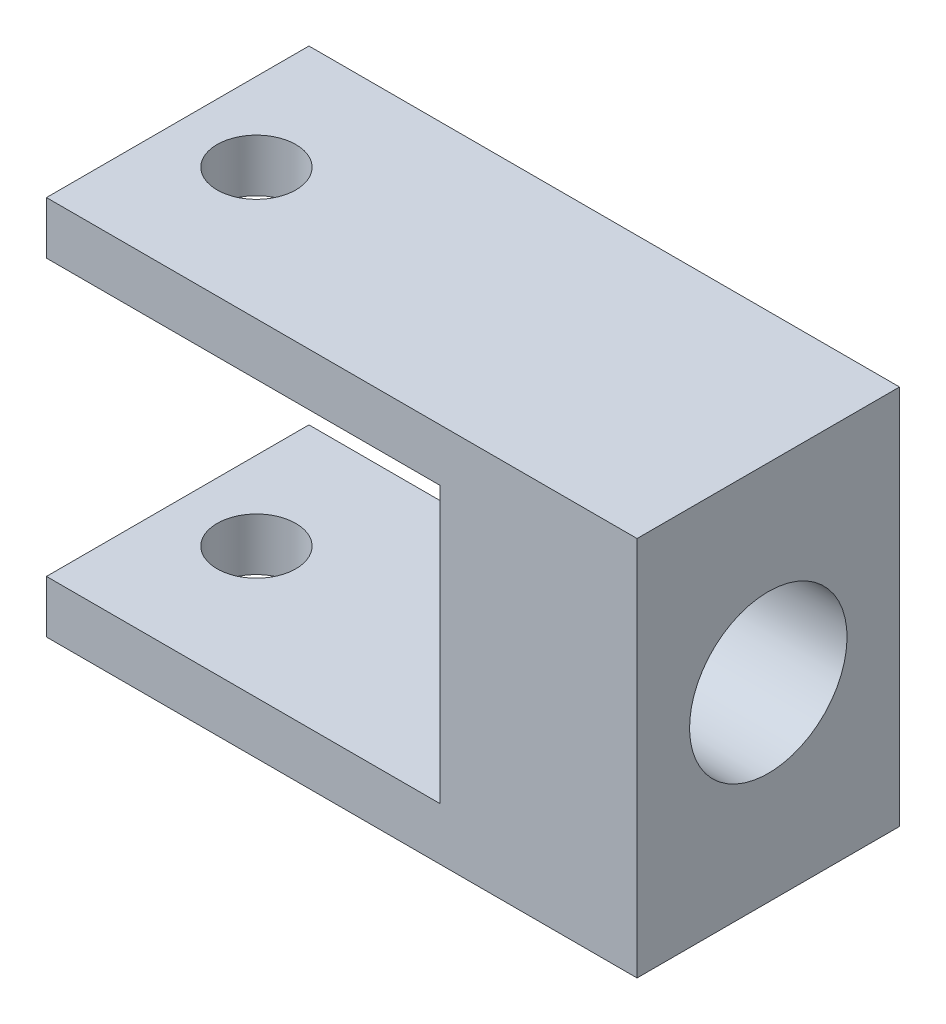
ISO-10303-21;
HEADER;
FILE_DESCRIPTION(('STEP AP214'),'2;1');
FILE_NAME('part.step','',(''),(''),'','','');
FILE_SCHEMA(('AUTOMOTIVE_DESIGN { 1 0 10303 214 1 1 1 1 }'));
ENDSEC;
DATA;
#1=APPLICATION_CONTEXT('core data for automotive mechanical design processes');
#2=APPLICATION_PROTOCOL_DEFINITION('international standard','automotive_design',2000,#1);
#3=PRODUCT_CONTEXT('',#1,'mechanical');
#4=PRODUCT('Part','Part','',(#3));
#5=PRODUCT_RELATED_PRODUCT_CATEGORY('part','',(#4));
#6=PRODUCT_DEFINITION_FORMATION('','',#4);
#7=PRODUCT_DEFINITION_CONTEXT('part definition',#1,'design');
#8=PRODUCT_DEFINITION('design','',#6,#7);
#9=PRODUCT_DEFINITION_SHAPE('','',#8);
#10=(LENGTH_UNIT() NAMED_UNIT(*) SI_UNIT(.MILLI.,.METRE.));
#11=(NAMED_UNIT(*) PLANE_ANGLE_UNIT() SI_UNIT($,.RADIAN.));
#12=(NAMED_UNIT(*) SI_UNIT($,.STERADIAN.) SOLID_ANGLE_UNIT());
#13=UNCERTAINTY_MEASURE_WITH_UNIT(LENGTH_MEASURE(1.E-05),#10,'distance_accuracy_value','');
#14=(GEOMETRIC_REPRESENTATION_CONTEXT(3) GLOBAL_UNCERTAINTY_ASSIGNED_CONTEXT((#13)) GLOBAL_UNIT_ASSIGNED_CONTEXT((#10,
#11,#12)) REPRESENTATION_CONTEXT('',''));
#15=CARTESIAN_POINT('',(0.,0.,0.));
#16=DIRECTION('',(0.,0.,1.));
#17=DIRECTION('',(1.,0.,0.));
#18=AXIS2_PLACEMENT_3D('',#15,#16,#17);
#19=CARTESIAN_POINT('',(-22.5,14.5,20.));
#20=DIRECTION('',(1.,0.,0.));
#21=DIRECTION('',(0.,0.,-1.));
#22=AXIS2_PLACEMENT_3D('',#19,#20,#21);
#23=PLANE('',#22);
#24=DIRECTION('',(0.,-1.,0.));
#25=VECTOR('',#24,1.);
#26=CARTESIAN_POINT('',(-22.5,14.5,0.));
#27=LINE('',#26,#25);
#28=CARTESIAN_POINT('',(-22.5,14.5,0.));
#29=VERTEX_POINT('',#28);
#30=CARTESIAN_POINT('',(-22.5,10.5,0.));
#31=VERTEX_POINT('',#30);
#32=EDGE_CURVE('E132',#29,#31,#27,.T.);
#33=ORIENTED_EDGE('',*,*,#32,.T.);
#34=DIRECTION('',(0.,0.,-1.));
#35=VECTOR('',#34,1.);
#36=CARTESIAN_POINT('',(-22.5,10.5,20.));
#37=LINE('',#36,#35);
#38=CARTESIAN_POINT('',(-22.5,10.5,20.));
#39=VERTEX_POINT('',#38);
#40=EDGE_CURVE('E11',#39,#31,#37,.T.);
#41=ORIENTED_EDGE('',*,*,#40,.F.);
#42=DIRECTION('',(0.,-1.,0.));
#43=VECTOR('',#42,1.);
#44=CARTESIAN_POINT('',(-22.5,14.5,20.));
#45=LINE('',#44,#43);
#46=CARTESIAN_POINT('',(-22.5,14.5,20.));
#47=VERTEX_POINT('',#46);
#48=EDGE_CURVE('E147',#47,#39,#45,.T.);
#49=ORIENTED_EDGE('',*,*,#48,.F.);
#50=DIRECTION('',(0.,0.,-1.));
#51=VECTOR('',#50,1.);
#52=CARTESIAN_POINT('',(-22.5,14.5,20.));
#53=LINE('',#52,#51);
#54=EDGE_CURVE('E128',#47,#29,#53,.T.);
#55=ORIENTED_EDGE('',*,*,#54,.T.);
#56=EDGE_LOOP('',(#33,#41,#49,#55));
#57=FACE_BOUND('',#56,.T.);
#58=ADVANCED_FACE('F35',(#57),#23,.F.);
#59=CARTESIAN_POINT('',(-22.5,10.5,20.));
#60=DIRECTION('',(0.,1.,0.));
#61=DIRECTION('',(0.,0.,1.));
#62=AXIS2_PLACEMENT_3D('',#59,#60,#61);
#63=PLANE('',#62);
#64=CARTESIAN_POINT('',(-16.5,10.5,10.));
#65=DIRECTION('',(0.,1.,0.));
#66=DIRECTION('',(0.,0.,1.));
#67=AXIS2_PLACEMENT_3D('',#64,#65,#66);
#68=CIRCLE('',#67,3.);
#69=CARTESIAN_POINT('',(-16.5,10.5,13.));
#70=VERTEX_POINT('',#69);
#71=EDGE_CURVE('E186',#70,#70,#68,.T.);
#72=ORIENTED_EDGE('',*,*,#71,.T.);
#73=EDGE_LOOP('',(#72));
#74=FACE_BOUND('',#73,.T.);
#75=DIRECTION('',(1.,0.,0.));
#76=VECTOR('',#75,1.);
#77=CARTESIAN_POINT('',(-22.5,10.5,0.));
#78=LINE('',#77,#76);
#79=CARTESIAN_POINT('',(7.5,10.5,0.));
#80=VERTEX_POINT('',#79);
#81=EDGE_CURVE('E135',#31,#80,#78,.T.);
#82=ORIENTED_EDGE('',*,*,#81,.T.);
#83=DIRECTION('',(0.,0.,-1.));
#84=VECTOR('',#83,1.);
#85=CARTESIAN_POINT('',(7.5,10.5,20.));
#86=LINE('',#85,#84);
#87=CARTESIAN_POINT('',(7.5,10.5,20.));
#88=VERTEX_POINT('',#87);
#89=EDGE_CURVE('E44',#88,#80,#86,.T.);
#90=ORIENTED_EDGE('',*,*,#89,.F.);
#91=DIRECTION('',(1.,0.,0.));
#92=VECTOR('',#91,1.);
#93=CARTESIAN_POINT('',(-22.5,10.5,20.));
#94=LINE('',#93,#92);
#95=EDGE_CURVE('E95',#39,#88,#94,.T.);
#96=ORIENTED_EDGE('',*,*,#95,.F.);
#97=ORIENTED_EDGE('',*,*,#40,.T.);
#98=EDGE_LOOP('',(#82,#90,#96,#97));
#99=FACE_BOUND('',#98,.T.);
#100=ADVANCED_FACE('F209',(#74,#99),#63,.F.);
#101=CARTESIAN_POINT('',(7.5,10.5,20.));
#102=DIRECTION('',(1.,0.,0.));
#103=DIRECTION('',(0.,1.,0.));
#104=AXIS2_PLACEMENT_3D('',#101,#102,#103);
#105=PLANE('',#104);
#106=CARTESIAN_POINT('',(7.5,0.,10.));
#107=DIRECTION('',(1.,0.,0.));
#108=DIRECTION('',(0.,1.,0.));
#109=AXIS2_PLACEMENT_3D('',#106,#107,#108);
#110=CIRCLE('',#109,6.);
#111=CARTESIAN_POINT('',(7.5,5.99999999999999,10.));
#112=VERTEX_POINT('',#111);
#113=EDGE_CURVE('E136',#112,#112,#110,.T.);
#114=ORIENTED_EDGE('',*,*,#113,.T.);
#115=EDGE_LOOP('',(#114));
#116=FACE_BOUND('',#115,.T.);
#117=DIRECTION('',(0.,-1.,0.));
#118=VECTOR('',#117,1.);
#119=CARTESIAN_POINT('',(7.5,10.5,0.));
#120=LINE('',#119,#118);
#121=CARTESIAN_POINT('',(7.5,-10.5,0.));
#122=VERTEX_POINT('',#121);
#123=EDGE_CURVE('E138',#80,#122,#120,.T.);
#124=ORIENTED_EDGE('',*,*,#123,.T.);
#125=DIRECTION('',(0.,0.,-1.));
#126=VECTOR('',#125,1.);
#127=CARTESIAN_POINT('',(7.5,-10.5,20.));
#128=LINE('',#127,#126);
#129=CARTESIAN_POINT('',(7.5,-10.5,20.));
#130=VERTEX_POINT('',#129);
#131=EDGE_CURVE('E154',#130,#122,#128,.T.);
#132=ORIENTED_EDGE('',*,*,#131,.F.);
#133=DIRECTION('',(0.,-1.,0.));
#134=VECTOR('',#133,1.);
#135=CARTESIAN_POINT('',(7.5,10.5,20.));
#136=LINE('',#135,#134);
#137=EDGE_CURVE('E163',#88,#130,#136,.T.);
#138=ORIENTED_EDGE('',*,*,#137,.F.);
#139=ORIENTED_EDGE('',*,*,#89,.T.);
#140=EDGE_LOOP('',(#124,#132,#138,#139));
#141=FACE_BOUND('',#140,.T.);
#142=ADVANCED_FACE('F161',(#116,#141),#105,.F.);
#143=CARTESIAN_POINT('',(-22.5,-10.5,20.));
#144=DIRECTION('',(0.,-1.,0.));
#145=DIRECTION('',(0.,0.,-1.));
#146=AXIS2_PLACEMENT_3D('',#143,#144,#145);
#147=PLANE('',#146);
#148=CARTESIAN_POINT('',(-16.5,-10.5,10.));
#149=DIRECTION('',(0.,-1.,0.));
#150=DIRECTION('',(0.,0.,-1.));
#151=AXIS2_PLACEMENT_3D('',#148,#149,#150);
#152=CIRCLE('',#151,3.);
#153=CARTESIAN_POINT('',(-16.5,-10.5,7.));
#154=VERTEX_POINT('',#153);
#155=EDGE_CURVE('E189',#154,#154,#152,.T.);
#156=ORIENTED_EDGE('',*,*,#155,.T.);
#157=EDGE_LOOP('',(#156));
#158=FACE_BOUND('',#157,.T.);
#159=DIRECTION('',(-1.,0.,0.));
#160=VECTOR('',#159,1.);
#161=CARTESIAN_POINT('',(-22.5,-10.5,0.));
#162=LINE('',#161,#160);
#163=CARTESIAN_POINT('',(-22.5,-10.5,0.));
#164=VERTEX_POINT('',#163);
#165=EDGE_CURVE('E140',#122,#164,#162,.T.);
#166=ORIENTED_EDGE('',*,*,#165,.T.);
#167=DIRECTION('',(0.,0.,-1.));
#168=VECTOR('',#167,1.);
#169=CARTESIAN_POINT('',(-22.5,-10.5,20.));
#170=LINE('',#169,#168);
#171=CARTESIAN_POINT('',(-22.5,-10.5,20.));
#172=VERTEX_POINT('',#171);
#173=EDGE_CURVE('E151',#172,#164,#170,.T.);
#174=ORIENTED_EDGE('',*,*,#173,.F.);
#175=DIRECTION('',(-1.,0.,0.));
#176=VECTOR('',#175,1.);
#177=CARTESIAN_POINT('',(-22.5,-10.5,20.));
#178=LINE('',#177,#176);
#179=EDGE_CURVE('E175',#130,#172,#178,.T.);
#180=ORIENTED_EDGE('',*,*,#179,.F.);
#181=ORIENTED_EDGE('',*,*,#131,.T.);
#182=EDGE_LOOP('',(#166,#174,#180,#181));
#183=FACE_BOUND('',#182,.T.);
#184=ADVANCED_FACE('F171',(#158,#183),#147,.F.);
#185=CARTESIAN_POINT('',(-22.5,-10.5,20.));
#186=DIRECTION('',(1.,0.,0.));
#187=DIRECTION('',(0.,0.,-1.));
#188=AXIS2_PLACEMENT_3D('',#185,#186,#187);
#189=PLANE('',#188);
#190=DIRECTION('',(0.,-1.,0.));
#191=VECTOR('',#190,1.);
#192=CARTESIAN_POINT('',(-22.5,-10.5,0.));
#193=LINE('',#192,#191);
#194=CARTESIAN_POINT('',(-22.5,-14.5,0.));
#195=VERTEX_POINT('',#194);
#196=EDGE_CURVE('E142',#164,#195,#193,.T.);
#197=ORIENTED_EDGE('',*,*,#196,.T.);
#198=DIRECTION('',(0.,0.,-1.));
#199=VECTOR('',#198,1.);
#200=CARTESIAN_POINT('',(-22.5,-14.5,20.));
#201=LINE('',#200,#199);
#202=CARTESIAN_POINT('',(-22.5,-14.5,20.));
#203=VERTEX_POINT('',#202);
#204=EDGE_CURVE('E123',#203,#195,#201,.T.);
#205=ORIENTED_EDGE('',*,*,#204,.F.);
#206=DIRECTION('',(0.,-1.,0.));
#207=VECTOR('',#206,1.);
#208=CARTESIAN_POINT('',(-22.5,-10.5,20.));
#209=LINE('',#208,#207);
#210=EDGE_CURVE('E114',#172,#203,#209,.T.);
#211=ORIENTED_EDGE('',*,*,#210,.F.);
#212=ORIENTED_EDGE('',*,*,#173,.T.);
#213=EDGE_LOOP('',(#197,#205,#211,#212));
#214=FACE_BOUND('',#213,.T.);
#215=ADVANCED_FACE('F174',(#214),#189,.F.);
#216=CARTESIAN_POINT('',(-22.5,-14.5,20.));
#217=DIRECTION('',(0.,1.,0.));
#218=DIRECTION('',(0.,0.,1.));
#219=AXIS2_PLACEMENT_3D('',#216,#217,#218);
#220=PLANE('',#219);
#221=CARTESIAN_POINT('',(-16.5,-14.5,10.));
#222=DIRECTION('',(0.,-1.,0.));
#223=DIRECTION('',(0.,0.,-1.));
#224=AXIS2_PLACEMENT_3D('',#221,#222,#223);
#225=CIRCLE('',#224,3.);
#226=CARTESIAN_POINT('',(-16.5,-14.5,7.));
#227=VERTEX_POINT('',#226);
#228=EDGE_CURVE('E192',#227,#227,#225,.T.);
#229=ORIENTED_EDGE('',*,*,#228,.F.);
#230=EDGE_LOOP('',(#229));
#231=FACE_BOUND('',#230,.T.);
#232=DIRECTION('',(1.,0.,0.));
#233=VECTOR('',#232,1.);
#234=CARTESIAN_POINT('',(-22.5,-14.5,0.));
#235=LINE('',#234,#233);
#236=CARTESIAN_POINT('',(22.5,-14.5,0.));
#237=VERTEX_POINT('',#236);
#238=EDGE_CURVE('E122',#195,#237,#235,.T.);
#239=ORIENTED_EDGE('',*,*,#238,.T.);
#240=DIRECTION('',(0.,0.,-1.));
#241=VECTOR('',#240,1.);
#242=CARTESIAN_POINT('',(22.5,-14.5,20.));
#243=LINE('',#242,#241);
#244=CARTESIAN_POINT('',(22.5,-14.5,20.));
#245=VERTEX_POINT('',#244);
#246=EDGE_CURVE('E119',#245,#237,#243,.T.);
#247=ORIENTED_EDGE('',*,*,#246,.F.);
#248=DIRECTION('',(1.,0.,0.));
#249=VECTOR('',#248,1.);
#250=CARTESIAN_POINT('',(-22.5,-14.5,20.));
#251=LINE('',#250,#249);
#252=EDGE_CURVE('E108',#203,#245,#251,.T.);
#253=ORIENTED_EDGE('',*,*,#252,.F.);
#254=ORIENTED_EDGE('',*,*,#204,.T.);
#255=EDGE_LOOP('',(#239,#247,#253,#254));
#256=FACE_BOUND('',#255,.T.);
#257=ADVANCED_FACE('F120',(#231,#256),#220,.F.);
#258=CARTESIAN_POINT('',(22.5,14.5,20.));
#259=DIRECTION('',(-1.,0.,0.));
#260=DIRECTION('',(0.,-1.,0.));
#261=AXIS2_PLACEMENT_3D('',#258,#259,#260);
#262=PLANE('',#261);
#263=CARTESIAN_POINT('',(22.5,0.,10.));
#264=DIRECTION('',(1.,0.,0.));
#265=DIRECTION('',(0.,1.,0.));
#266=AXIS2_PLACEMENT_3D('',#263,#264,#265);
#267=CIRCLE('',#266,6.);
#268=CARTESIAN_POINT('',(22.5,5.99999999999999,10.));
#269=VERTEX_POINT('',#268);
#270=EDGE_CURVE('E183',#269,#269,#267,.T.);
#271=ORIENTED_EDGE('',*,*,#270,.F.);
#272=EDGE_LOOP('',(#271));
#273=FACE_BOUND('',#272,.T.);
#274=DIRECTION('',(0.,1.,0.));
#275=VECTOR('',#274,1.);
#276=CARTESIAN_POINT('',(22.5,14.5,0.));
#277=LINE('',#276,#275);
#278=CARTESIAN_POINT('',(22.5,14.5,0.));
#279=VERTEX_POINT('',#278);
#280=EDGE_CURVE('E81',#237,#279,#277,.T.);
#281=ORIENTED_EDGE('',*,*,#280,.T.);
#282=DIRECTION('',(0.,0.,-1.));
#283=VECTOR('',#282,1.);
#284=CARTESIAN_POINT('',(22.5,14.5,20.));
#285=LINE('',#284,#283);
#286=CARTESIAN_POINT('',(22.5,14.5,20.));
#287=VERTEX_POINT('',#286);
#288=EDGE_CURVE('E124',#287,#279,#285,.T.);
#289=ORIENTED_EDGE('',*,*,#288,.F.);
#290=DIRECTION('',(0.,1.,0.));
#291=VECTOR('',#290,1.);
#292=CARTESIAN_POINT('',(22.5,14.5,20.));
#293=LINE('',#292,#291);
#294=EDGE_CURVE('E112',#245,#287,#293,.T.);
#295=ORIENTED_EDGE('',*,*,#294,.F.);
#296=ORIENTED_EDGE('',*,*,#246,.T.);
#297=EDGE_LOOP('',(#281,#289,#295,#296));
#298=FACE_BOUND('',#297,.T.);
#299=ADVANCED_FACE('F126',(#273,#298),#262,.F.);
#300=CARTESIAN_POINT('',(-22.5,14.5,20.));
#301=DIRECTION('',(0.,-1.,0.));
#302=DIRECTION('',(0.,0.,-1.));
#303=AXIS2_PLACEMENT_3D('',#300,#301,#302);
#304=PLANE('',#303);
#305=CARTESIAN_POINT('',(-16.5,14.5,10.));
#306=DIRECTION('',(0.,-1.,0.));
#307=DIRECTION('',(0.,0.,-1.));
#308=AXIS2_PLACEMENT_3D('',#305,#306,#307);
#309=CIRCLE('',#308,3.);
#310=CARTESIAN_POINT('',(-16.5,14.5,7.));
#311=VERTEX_POINT('',#310);
#312=EDGE_CURVE('E38',#311,#311,#309,.T.);
#313=ORIENTED_EDGE('',*,*,#312,.T.);
#314=EDGE_LOOP('',(#313));
#315=FACE_BOUND('',#314,.T.);
#316=DIRECTION('',(-1.,0.,0.));
#317=VECTOR('',#316,1.);
#318=CARTESIAN_POINT('',(-22.5,14.5,0.));
#319=LINE('',#318,#317);
#320=EDGE_CURVE('E87',#279,#29,#319,.T.);
#321=ORIENTED_EDGE('',*,*,#320,.T.);
#322=ORIENTED_EDGE('',*,*,#54,.F.);
#323=DIRECTION('',(-1.,0.,0.));
#324=VECTOR('',#323,1.);
#325=CARTESIAN_POINT('',(-22.5,14.5,20.));
#326=LINE('',#325,#324);
#327=EDGE_CURVE('E52',#287,#47,#326,.T.);
#328=ORIENTED_EDGE('',*,*,#327,.F.);
#329=ORIENTED_EDGE('',*,*,#288,.T.);
#330=EDGE_LOOP('',(#321,#322,#328,#329));
#331=FACE_BOUND('',#330,.T.);
#332=ADVANCED_FACE('F199',(#315,#331),#304,.F.);
#333=CARTESIAN_POINT('',(0.,0.,20.));
#334=DIRECTION('',(0.,0.,1.));
#335=DIRECTION('',(1.,0.,0.));
#336=AXIS2_PLACEMENT_3D('',#333,#334,#335);
#337=PLANE('',#336);
#338=ORIENTED_EDGE('',*,*,#48,.T.);
#339=ORIENTED_EDGE('',*,*,#95,.T.);
#340=ORIENTED_EDGE('',*,*,#137,.T.);
#341=ORIENTED_EDGE('',*,*,#179,.T.);
#342=ORIENTED_EDGE('',*,*,#210,.T.);
#343=ORIENTED_EDGE('',*,*,#252,.T.);
#344=ORIENTED_EDGE('',*,*,#294,.T.);
#345=ORIENTED_EDGE('',*,*,#327,.T.);
#346=EDGE_LOOP('',(#338,#339,#340,#341,#342,#343,#344,#345));
#347=FACE_BOUND('',#346,.T.);
#348=ADVANCED_FACE('F110',(#347),#337,.T.);
#349=CARTESIAN_POINT('',(0.,0.,0.));
#350=DIRECTION('',(0.,0.,1.));
#351=DIRECTION('',(1.,0.,0.));
#352=AXIS2_PLACEMENT_3D('',#349,#350,#351);
#353=PLANE('',#352);
#354=ORIENTED_EDGE('',*,*,#32,.F.);
#355=ORIENTED_EDGE('',*,*,#320,.F.);
#356=ORIENTED_EDGE('',*,*,#280,.F.);
#357=ORIENTED_EDGE('',*,*,#238,.F.);
#358=ORIENTED_EDGE('',*,*,#196,.F.);
#359=ORIENTED_EDGE('',*,*,#165,.F.);
#360=ORIENTED_EDGE('',*,*,#123,.F.);
#361=ORIENTED_EDGE('',*,*,#81,.F.);
#362=EDGE_LOOP('',(#354,#355,#356,#357,#358,#359,#360,#361));
#363=FACE_BOUND('',#362,.T.);
#364=ADVANCED_FACE('F167',(#363),#353,.F.);
#365=CARTESIAN_POINT('',(2.5,0.,10.));
#366=DIRECTION('',(1.,0.,0.));
#367=DIRECTION('',(0.,1.,0.));
#368=AXIS2_PLACEMENT_3D('',#365,#366,#367);
#369=CYLINDRICAL_SURFACE('',#368,6.);
#370=ORIENTED_EDGE('',*,*,#270,.T.);
#371=EDGE_LOOP('',(#370));
#372=FACE_BOUND('',#371,.T.);
#373=ORIENTED_EDGE('',*,*,#113,.F.);
#374=EDGE_LOOP('',(#373));
#375=FACE_BOUND('',#374,.T.);
#376=ADVANCED_FACE('F205',(#372,#375),#369,.F.);
#377=CARTESIAN_POINT('',(-16.5,25.5,10.));
#378=DIRECTION('',(0.,-1.,0.));
#379=DIRECTION('',(0.,0.,-1.));
#380=AXIS2_PLACEMENT_3D('',#377,#378,#379);
#381=CYLINDRICAL_SURFACE('',#380,3.);
#382=ORIENTED_EDGE('',*,*,#312,.F.);
#383=EDGE_LOOP('',(#382));
#384=FACE_BOUND('',#383,.T.);
#385=ORIENTED_EDGE('',*,*,#71,.F.);
#386=EDGE_LOOP('',(#385));
#387=FACE_BOUND('',#386,.T.);
#388=ADVANCED_FACE('F201',(#384,#387),#381,.F.);
#389=ORIENTED_EDGE('',*,*,#228,.T.);
#390=EDGE_LOOP('',(#389));
#391=FACE_BOUND('',#390,.T.);
#392=ORIENTED_EDGE('',*,*,#155,.F.);
#393=EDGE_LOOP('',(#392));
#394=FACE_BOUND('',#393,.T.);
#395=ADVANCED_FACE('F204',(#391,#394),#381,.F.);
#396=CLOSED_SHELL('',(#58,#100,#142,#184,#215,#257,#299,#332,#348,#364,#376,#388,#395));
#397=MANIFOLD_SOLID_BREP('B2',#396);
#398=ADVANCED_BREP_SHAPE_REPRESENTATION('',(#18,#397),#14);
#399=SHAPE_DEFINITION_REPRESENTATION(#9,#398);
ENDSEC;
END-ISO-10303-21;
